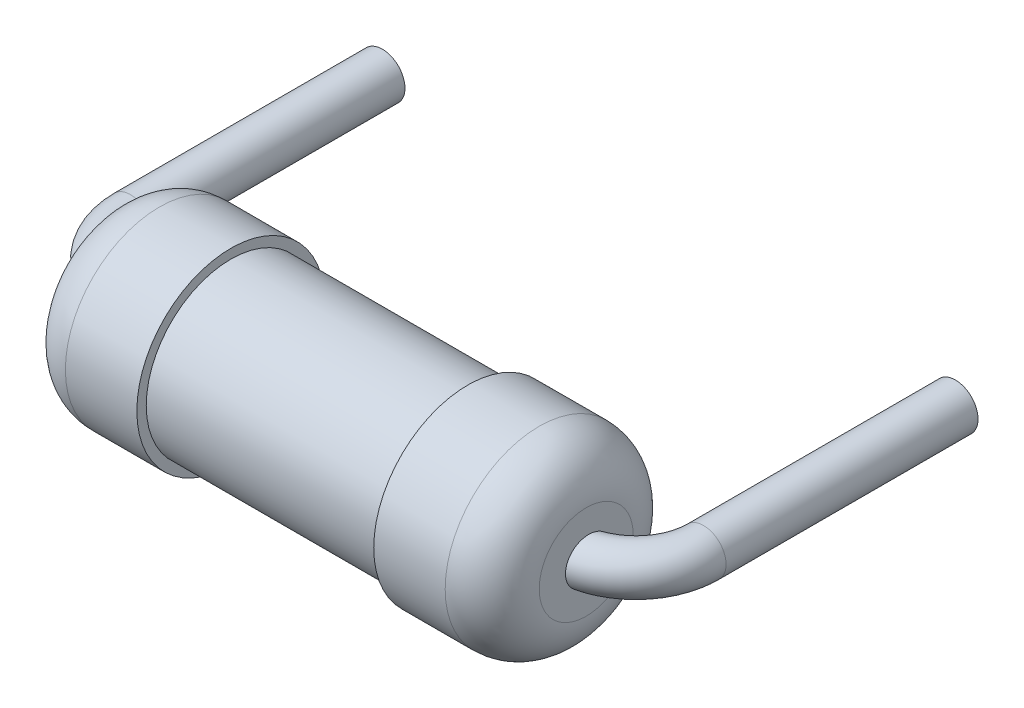
ISO-10303-21;
HEADER;
FILE_DESCRIPTION(('STEP AP214'),'2;1');
FILE_NAME('part.step','',(''),(''),'','','');
FILE_SCHEMA(('AUTOMOTIVE_DESIGN { 1 0 10303 214 1 1 1 1 }'));
ENDSEC;
DATA;
#1=APPLICATION_CONTEXT('core data for automotive mechanical design processes');
#2=APPLICATION_PROTOCOL_DEFINITION('international standard','automotive_design',2000,#1);
#3=PRODUCT_CONTEXT('',#1,'mechanical');
#4=PRODUCT('Part','Part','',(#3));
#5=PRODUCT_RELATED_PRODUCT_CATEGORY('part','',(#4));
#6=PRODUCT_DEFINITION_FORMATION('','',#4);
#7=PRODUCT_DEFINITION_CONTEXT('part definition',#1,'design');
#8=PRODUCT_DEFINITION('design','',#6,#7);
#9=PRODUCT_DEFINITION_SHAPE('','',#8);
#10=(LENGTH_UNIT() NAMED_UNIT(*) SI_UNIT(.MILLI.,.METRE.));
#11=(NAMED_UNIT(*) PLANE_ANGLE_UNIT() SI_UNIT($,.RADIAN.));
#12=(NAMED_UNIT(*) SI_UNIT($,.STERADIAN.) SOLID_ANGLE_UNIT());
#13=UNCERTAINTY_MEASURE_WITH_UNIT(LENGTH_MEASURE(1.E-05),#10,'distance_accuracy_value','');
#14=(GEOMETRIC_REPRESENTATION_CONTEXT(3) GLOBAL_UNCERTAINTY_ASSIGNED_CONTEXT((#13)) GLOBAL_UNIT_ASSIGNED_CONTEXT((#10,
#11,#12)) REPRESENTATION_CONTEXT('',''));
#15=CARTESIAN_POINT('',(0.,0.,0.));
#16=DIRECTION('',(0.,0.,1.));
#17=DIRECTION('',(1.,0.,0.));
#18=AXIS2_PLACEMENT_3D('',#15,#16,#17);
#19=CARTESIAN_POINT('',(7.32,-0.30606,-3.));
#20=DIRECTION('',(0.,0.,1.));
#21=DIRECTION('',(1.,0.,0.));
#22=AXIS2_PLACEMENT_3D('',#19,#20,#21);
#23=PLANE('',#22);
#24=CARTESIAN_POINT('',(7.61999999999981,0.,-3.));
#25=DIRECTION('',(0.,0.,-1.));
#26=DIRECTION('',(-1.,0.,0.));
#27=AXIS2_PLACEMENT_3D('',#24,#25,#26);
#28=CIRCLE('',#27,0.29999999999984);
#29=CARTESIAN_POINT('',(7.31999999999997,0.,-3.));
#30=VERTEX_POINT('',#29);
#31=EDGE_CURVE('E19',#30,#30,#28,.F.);
#32=ORIENTED_EDGE('',*,*,#31,.F.);
#33=EDGE_LOOP('',(#32));
#34=FACE_BOUND('',#33,.T.);
#35=ADVANCED_FACE('F15',(#34),#23,.F.);
#36=CARTESIAN_POINT('',(7.61999999999981,0.,0.35));
#37=DIRECTION('',(0.,0.,-1.));
#38=DIRECTION('',(-1.,0.,0.));
#39=AXIS2_PLACEMENT_3D('',#36,#37,#38);
#40=CYLINDRICAL_SURFACE('',#39,0.29999999999984);
#41=ORIENTED_EDGE('',*,*,#31,.T.);
#42=EDGE_LOOP('',(#41));
#43=FACE_BOUND('',#42,.T.);
#44=CARTESIAN_POINT('',(7.61999999999981,0.,0.35));
#45=DIRECTION('',(0.,0.,1.));
#46=DIRECTION('',(1.,0.,0.));
#47=AXIS2_PLACEMENT_3D('',#44,#45,#46);
#48=CIRCLE('',#47,0.29999999999984);
#49=CARTESIAN_POINT('',(7.91999999999965,0.,0.35));
#50=VERTEX_POINT('',#49);
#51=EDGE_CURVE('E31',#50,#50,#48,.T.);
#52=ORIENTED_EDGE('',*,*,#51,.F.);
#53=EDGE_LOOP('',(#52));
#54=FACE_BOUND('',#53,.T.);
#55=ADVANCED_FACE('F117',(#43,#54),#40,.T.);
#56=CARTESIAN_POINT('',(0.3,-0.30606,-3.));
#57=DIRECTION('',(0.,0.,-1.));
#58=DIRECTION('',(-1.,0.,0.));
#59=AXIS2_PLACEMENT_3D('',#56,#57,#58);
#60=PLANE('',#59);
#61=CARTESIAN_POINT('',(1.94411002053807E-13,0.,-3.));
#62=DIRECTION('',(0.,0.,1.));
#63=DIRECTION('',(1.,0.,0.));
#64=AXIS2_PLACEMENT_3D('',#61,#62,#63);
#65=CIRCLE('',#64,0.29999999999984);
#66=CARTESIAN_POINT('',(0.300000000000034,0.,-3.));
#67=VERTEX_POINT('',#66);
#68=EDGE_CURVE('E104',#67,#67,#65,.T.);
#69=ORIENTED_EDGE('',*,*,#68,.F.);
#70=EDGE_LOOP('',(#69));
#71=FACE_BOUND('',#70,.T.);
#72=ADVANCED_FACE('F125',(#71),#60,.T.);
#73=CARTESIAN_POINT('',(1.94411002053807E-13,0.,-3.));
#74=DIRECTION('',(0.,0.,1.));
#75=DIRECTION('',(1.,0.,0.));
#76=AXIS2_PLACEMENT_3D('',#73,#74,#75);
#77=CYLINDRICAL_SURFACE('',#76,0.29999999999984);
#78=CARTESIAN_POINT('',(1.94749815232709E-13,0.,0.35));
#79=DIRECTION('',(0.,0.,1.));
#80=DIRECTION('',(1.,0.,0.));
#81=AXIS2_PLACEMENT_3D('',#78,#79,#80);
#82=CIRCLE('',#81,0.29999999999984);
#83=CARTESIAN_POINT('',(0.300000000000035,0.,0.35));
#84=VERTEX_POINT('',#83);
#85=EDGE_CURVE('E102',#84,#84,#82,.T.);
#86=ORIENTED_EDGE('',*,*,#85,.F.);
#87=EDGE_LOOP('',(#86));
#88=FACE_BOUND('',#87,.T.);
#89=ORIENTED_EDGE('',*,*,#68,.T.);
#90=EDGE_LOOP('',(#89));
#91=FACE_BOUND('',#90,.T.);
#92=ADVANCED_FACE('F130',(#88,#91),#77,.T.);
#93=CARTESIAN_POINT('',(6.71999999999944,0.,0.349999999999999));
#94=DIRECTION('',(0.,1.,0.));
#95=DIRECTION('',(-1.,0.,0.));
#96=AXIS2_PLACEMENT_3D('',#93,#94,#95);
#97=TOROIDAL_SURFACE('',#96,0.899999999999279,0.299999999999489);
#98=CARTESIAN_POINT('',(6.96000000200153,0.,1.52575507816879));
#99=CARTESIAN_POINT('',(6.96000000239898,-0.0165717465702592,1.52575366689773));
#100=CARTESIAN_POINT('',(6.96000000064341,-0.0331576062207583,1.52434822630381));
#101=CARTESIAN_POINT('',(6.95999999935524,-0.0658828957445996,1.518760968371));
#102=CARTESIAN_POINT('',(6.95999999982733,-0.0820213152024847,1.51457332807748));
#103=CARTESIAN_POINT('',(6.96000000017247,-0.113348816615965,1.50355401757945));
#104=CARTESIAN_POINT('',(6.96000000004622,-0.128538973196427,1.49672540585315));
#105=CARTESIAN_POINT('',(6.9599999999538,-0.157560450627169,1.48063593905333));
#106=CARTESIAN_POINT('',(6.95999999998758,-0.171392368333133,1.47137615894805));
#107=CARTESIAN_POINT('',(6.96000000001251,-0.197432864941894,1.45062228585465));
#108=CARTESIAN_POINT('',(6.96000000000336,-0.209628545306149,1.43911201883619));
#109=CARTESIAN_POINT('',(6.95999999999664,-0.231959130917878,1.41424087231693));
#110=CARTESIAN_POINT('',(6.95999999999909,-0.242093718720324,1.40087970827691));
#111=CARTESIAN_POINT('',(6.96000000000092,-0.260228615435907,1.372416517639));
#112=CARTESIAN_POINT('',(6.96000000000025,-0.268184038441725,1.35728590846424));
#113=CARTESIAN_POINT('',(6.95999999999975,-0.281516811306086,1.32592981128039));
#114=CARTESIAN_POINT('',(6.95999999999993,-0.286893876392834,1.3097042025576));
#115=CARTESIAN_POINT('',(6.96000000000007,-0.295075780325206,1.27615269558577));
#116=CARTESIAN_POINT('',(6.96000000000002,-0.297807264113354,1.2588089191577));
#117=CARTESIAN_POINT('',(6.95999999999998,-0.300410822014324,1.22390857670864));
#118=CARTESIAN_POINT('',(6.95999999999999,-0.300282447435237,1.20635197772913));
#119=CARTESIAN_POINT('',(6.96000000000001,-0.29715910251184,1.17096630628855));
#120=CARTESIAN_POINT('',(6.96,-0.294078574038098,1.15314477222957));
#121=CARTESIAN_POINT('',(6.96,-0.285034910762784,1.11824738099647));
#122=CARTESIAN_POINT('',(6.96,-0.279071268028983,1.10117165579331));
#123=CARTESIAN_POINT('',(6.96,-0.264267898815892,1.06787386585412));
#124=CARTESIAN_POINT('',(6.96,-0.255369306022341,1.05167791922303));
#125=CARTESIAN_POINT('',(6.96,-0.23496045761772,1.02102069910626));
#126=CARTESIAN_POINT('',(6.96,-0.223450133263215,1.00655947129546));
#127=CARTESIAN_POINT('',(6.96,-0.198203092033218,0.979953759756814));
#128=CARTESIAN_POINT('',(6.96,-0.184485612526183,0.967791073045381));
#129=CARTESIAN_POINT('',(6.96,-0.15509338205597,0.946094783766567));
#130=CARTESIAN_POINT('',(6.96,-0.13941835189566,0.936561556851437));
#131=CARTESIAN_POINT('',(6.96,-0.107469905856262,0.921013444039079));
#132=CARTESIAN_POINT('',(6.96,-0.0912764867236528,0.914834240349325));
#133=CARTESIAN_POINT('',(6.96,-0.0580624647700204,0.905555799337871));
#134=CARTESIAN_POINT('',(6.96,-0.0410445486460067,0.902447182416433));
#135=CARTESIAN_POINT('',(6.96,-0.0159590419049933,0.900255534627323));
#136=CARTESIAN_POINT('',(6.96,-0.00798203854928741,0.899907973729281));
#137=CARTESIAN_POINT('',(6.96,0.0159391519228464,0.899911299259022));
#138=CARTESIAN_POINT('',(6.96,0.0318983817763698,0.901303845660108));
#139=CARTESIAN_POINT('',(6.96,0.0633648904786639,0.906813453242073));
#140=CARTESIAN_POINT('',(6.96,0.0788709896929494,0.910937060798986));
#141=CARTESIAN_POINT('',(6.96,0.108925948621917,0.921697884375491));
#142=CARTESIAN_POINT('',(6.96,0.123477708884365,0.928327025977768));
#143=CARTESIAN_POINT('',(6.96,0.151320221170094,0.943827197468842));
#144=CARTESIAN_POINT('',(6.96,0.164611333680649,0.952697583790299));
#145=CARTESIAN_POINT('',(6.96,0.190219362874737,0.972819500485144));
#146=CARTESIAN_POINT('',(6.96,0.202466858548362,0.984159241147546));
#147=CARTESIAN_POINT('',(6.96,0.225042095487014,1.00861184019665));
#148=CARTESIAN_POINT('',(6.96,0.235369137216857,1.02172534169215));
#149=CARTESIAN_POINT('',(6.96,0.254552458048837,1.05035899866851));
#150=CARTESIAN_POINT('',(6.96,0.263252811883518,1.06598381752323));
#151=CARTESIAN_POINT('',(6.96,0.278006061841171,1.09843823214625));
#152=CARTESIAN_POINT('',(6.96,0.284058405625977,1.11526807841547));
#153=CARTESIAN_POINT('',(6.96,0.293506450974995,1.15025941287104));
#154=CARTESIAN_POINT('',(6.96000000000001,0.296807654597934,1.16844653461609));
#155=CARTESIAN_POINT('',(6.95999999999999,0.300288413441444,1.2051185718321));
#156=CARTESIAN_POINT('',(6.95999999999997,0.30046797567003,1.22360348663442));
#157=CARTESIAN_POINT('',(6.96000000000003,0.29766769305614,1.26020661691794));
#158=CARTESIAN_POINT('',(6.9600000000001,0.294709597823849,1.27832648107846));
#159=CARTESIAN_POINT('',(6.9599999999999,0.28570596282675,1.31378369043589));
#160=CARTESIAN_POINT('',(6.95999999999964,0.279660812116659,1.33112113393994));
#161=CARTESIAN_POINT('',(6.96000000000035,0.26482667035609,1.36400922822503));
#162=CARTESIAN_POINT('',(6.9600000000013,0.256117396466872,1.37959582018153));
#163=CARTESIAN_POINT('',(6.9599999999987,0.236129026378305,1.40902256316334));
#164=CARTESIAN_POINT('',(6.95999999999515,0.224850581414088,1.42286315538672));
#165=CARTESIAN_POINT('',(6.9600000000047,0.200415519129505,1.44796272434007));
#166=CARTESIAN_POINT('',(6.9600000000173,0.187326195707308,1.45928723795935));
#167=CARTESIAN_POINT('',(6.95999999998269,0.159386195679297,1.47951897893741));
#168=CARTESIAN_POINT('',(6.95999999993546,0.144534942399504,1.48842541171226));
#169=CARTESIAN_POINT('',(6.96000000006307,0.113869961667255,1.50335184691495));
#170=CARTESIAN_POINT('',(6.96000000023284,0.0980860819871803,1.50943330659099));
#171=CARTESIAN_POINT('',(6.95999999976767,0.0657390556120207,1.51880335836358));
#172=CARTESIAN_POINT('',(6.9599999991345,0.049177716110643,1.5220981188035));
#173=CARTESIAN_POINT('',(6.96000000055857,0.0216899661657272,1.52515528192975));
#174=CARTESIAN_POINT('',(6.96000000174135,0.0108480068974013,1.52575600199889));
#175=CARTESIAN_POINT('',(6.96000000200153,0.,1.52575507816879));
#176=B_SPLINE_CURVE_WITH_KNOTS('',3,(#98,#99,#100,#101,#102,#103,#104,#105,#106,#107,#108,#109,
#110,#111,#112,#113,#114,#115,#116,#117,#118,#119,#120,#121,#122,#123,#124,#125,#126,#127,#128,
#129,#130,#131,#132,#133,#134,#135,#136,#137,#138,#139,#140,#141,#142,#143,#144,#145,#146,#147,
#148,#149,#150,#151,#152,#153,#154,#155,#156,#157,#158,#159,#160,#161,#162,#163,#164,#165,#166,
#167,#168,#169,#170,#171,#172,#173,#174,#175),.UNSPECIFIED.,.T.,.F.,(4,2,2,2,2,2,2,2,2,2,2,2,2,
2,2,2,2,2,2,2,2,2,2,2,2,2,2,2,2,2,2,2,2,2,2,2,2,2,4),(0.,0.049680736121407,0.0994657795787804,
0.149193339372714,0.19889894849212,0.248975868404632,0.299060495224995,0.35011015455782,
0.401165450872408,0.453598973876442,0.506040723393907,0.560049778387794,0.614068351888266,
0.66924393763271,0.724420975823266,0.77914083518832,0.833868507946833,0.885593975729398,
0.937160946583132,0.961094778677505,1.0088877056964,1.05679560939149,1.10455042197684,
1.15229153745048,1.20215158606851,1.25202976104181,1.30543981297232,1.3588610001937,
1.41404924179432,1.46923735949858,1.52404540904007,1.57884655294932,1.63214619044925,
1.68543233252715,1.73710326700358,1.78879116011017,1.83929480367792,1.88968636295174,
1.92220779729997),.UNSPECIFIED.);
#177=CARTESIAN_POINT('',(6.96000000200153,0.,1.52575507816879));
#178=VERTEX_POINT('',#177);
#179=EDGE_CURVE('E54',#178,#178,#176,.T.);
#180=ORIENTED_EDGE('',*,*,#179,.T.);
#181=EDGE_LOOP('',(#180));
#182=FACE_BOUND('',#181,.T.);
#183=ORIENTED_EDGE('',*,*,#51,.T.);
#184=EDGE_LOOP('',(#183));
#185=FACE_BOUND('',#184,.T.);
#186=ADVANCED_FACE('F133',(#182,#185),#97,.T.);
#187=CARTESIAN_POINT('',(0.899999999999423,0.,0.35));
#188=DIRECTION('',(0.,1.,0.));
#189=DIRECTION('',(-1.,0.,0.));
#190=AXIS2_PLACEMENT_3D('',#187,#188,#189);
#191=TOROIDAL_SURFACE('',#190,0.899999999999228,0.29999999999984);
#192=CARTESIAN_POINT('',(0.66,0.,0.899909083394285));
#193=CARTESIAN_POINT('',(0.66,0.015939151922877,0.899911299259076));
#194=CARTESIAN_POINT('',(0.66,0.0318983817764273,0.901303845660167));
#195=CARTESIAN_POINT('',(0.66,0.0633648904787725,0.906813453242143));
#196=CARTESIAN_POINT('',(0.66,0.0788709896930825,0.91093706079906));
#197=CARTESIAN_POINT('',(0.66,0.108925948622089,0.921697884375577));
#198=CARTESIAN_POINT('',(0.66,0.123477708884552,0.928327025977858));
#199=CARTESIAN_POINT('',(0.66,0.151320221170329,0.943827197468954));
#200=CARTESIAN_POINT('',(0.66,0.164611333680916,0.952697583790432));
#201=CARTESIAN_POINT('',(0.66,0.190219362875102,0.972819500485356));
#202=CARTESIAN_POINT('',(0.66,0.202466858548788,0.984159241147822));
#203=CARTESIAN_POINT('',(0.66,0.225042095487452,1.00861184019698));
#204=CARTESIAN_POINT('',(0.66,0.235369137217262,1.02172534169245));
#205=CARTESIAN_POINT('',(0.66,0.254552458049035,1.05035899866852));
#206=CARTESIAN_POINT('',(0.66,0.263252811883582,1.06598381752295));
#207=CARTESIAN_POINT('',(0.66,0.278006061841332,1.09843823214595));
#208=CARTESIAN_POINT('',(0.66,0.284058405626274,1.11526807841549));
#209=CARTESIAN_POINT('',(0.66,0.293506450975729,1.15025941287273));
#210=CARTESIAN_POINT('',(0.66,0.296807654598798,1.16844653461918));
#211=CARTESIAN_POINT('',(0.66,0.300288413441829,1.20511857183526));
#212=CARTESIAN_POINT('',(0.66,0.300467975670273,1.22360348663621));
#213=CARTESIAN_POINT('',(0.66,0.297667693056851,1.26020661691341));
#214=CARTESIAN_POINT('',(0.66,0.29470959782577,1.27832648106902));
#215=CARTESIAN_POINT('',(0.66,0.28570596283032,1.31378369042703));
#216=CARTESIAN_POINT('',(0.66,0.279660812119012,1.33112113393615));
#217=CARTESIAN_POINT('',(0.66,0.264826670350286,1.36400922823865));
#218=CARTESIAN_POINT('',(0.66,0.256117396452608,1.37959582020684));
#219=CARTESIAN_POINT('',(0.66,0.23612902635983,1.40902256318791));
#220=CARTESIAN_POINT('',(0.66,0.224850581404126,1.42286315540176));
#221=CARTESIAN_POINT('',(0.66,0.200415519154835,1.44796272431079));
#222=CARTESIAN_POINT('',(0.66,0.187326195761993,1.45928723789819));
#223=CARTESIAN_POINT('',(0.66,0.159386195742373,1.47951897891456));
#224=CARTESIAN_POINT('',(0.66,0.144534942434262,1.48842541174948));
#225=CARTESIAN_POINT('',(0.66,0.113869961615406,1.50335184688845));
#226=CARTESIAN_POINT('',(0.66,0.0980860818758177,1.50943330644199));
#227=CARTESIAN_POINT('',(0.66,0.0657390555095999,1.51880335857524));
#228=CARTESIAN_POINT('',(0.66,0.0491777160819807,1.52209811951517));
#229=CARTESIAN_POINT('',(0.66,0.0216899661803045,1.52515528147179));
#230=CARTESIAN_POINT('',(0.66,0.0108480069077052,1.52575600057752));
#231=CARTESIAN_POINT('',(0.66,-0.0165717466706921,1.52575366493966));
#232=CARTESIAN_POINT('',(0.66,-0.0331576064293321,1.52434822575765));
#233=CARTESIAN_POINT('',(0.66,-0.0658828959463421,1.51876096884922));
#234=CARTESIAN_POINT('',(0.66,-0.0820213152932457,1.51457332818834));
#235=CARTESIAN_POINT('',(0.66,-0.113348816556747,1.50355401745879));
#236=CARTESIAN_POINT('',(0.66,-0.128538973095773,1.49672540586089));
#237=CARTESIAN_POINT('',(0.66,-0.157560450538399,1.48063593915178));
#238=CARTESIAN_POINT('',(0.66,-0.171392368289278,1.47137615899373));
#239=CARTESIAN_POINT('',(0.66,-0.197432864955946,1.45062228583395));
#240=CARTESIAN_POINT('',(0.66,-0.209628545336172,1.43911201880586));
#241=CARTESIAN_POINT('',(0.66,-0.231959130942909,1.4142408722874));
#242=CARTESIAN_POINT('',(0.66,-0.242093718730023,1.40087970826285));
#243=CARTESIAN_POINT('',(0.66,-0.260228615429383,1.37241651764982));
#244=CARTESIAN_POINT('',(0.66,-0.268184038432296,1.35728590848324));
#245=CARTESIAN_POINT('',(0.66,-0.281516811299615,1.32592981130104));
#246=CARTESIAN_POINT('',(0.66,-0.286893876389798,1.30970420257066));
#247=CARTESIAN_POINT('',(0.66,-0.295075780325203,1.27615269558863));
#248=CARTESIAN_POINT('',(0.66,-0.297807264113813,1.25880891915815));
#249=CARTESIAN_POINT('',(0.66,-0.300410822014535,1.22390857670913));
#250=CARTESIAN_POINT('',(0.66,-0.300282447435548,1.20635197773214));
#251=CARTESIAN_POINT('',(0.66,-0.297159102513001,1.17096630629469));
#252=CARTESIAN_POINT('',(0.66,-0.294078574039725,1.15314477223635));
#253=CARTESIAN_POINT('',(0.66,-0.285034910765201,1.11824738100308));
#254=CARTESIAN_POINT('',(0.66,-0.279071268031507,1.10117165579916));
#255=CARTESIAN_POINT('',(0.66,-0.26426789881862,1.06787386585897));
#256=CARTESIAN_POINT('',(0.66,-0.255369306025244,1.0516779192276));
#257=CARTESIAN_POINT('',(0.66,-0.23496045762109,1.02102069911052));
#258=CARTESIAN_POINT('',(0.66,-0.223450133266924,1.00655947129967));
#259=CARTESIAN_POINT('',(0.66,-0.198203092037496,0.979953759760712));
#260=CARTESIAN_POINT('',(0.66,-0.18448561253067,0.967791073049037));
#261=CARTESIAN_POINT('',(0.66,-0.155093382060787,0.946094783769654));
#262=CARTESIAN_POINT('',(0.66,-0.139418351900591,0.936561556854207));
#263=CARTESIAN_POINT('',(0.66,-0.107469905861335,0.921013444041198));
#264=CARTESIAN_POINT('',(0.66,-0.0912764867287552,0.914834240351116));
#265=CARTESIAN_POINT('',(0.66,-0.0580624647751282,0.905555799339011));
#266=CARTESIAN_POINT('',(0.66,-0.0410445486510903,0.902447182417247));
#267=CARTESIAN_POINT('',(0.66,-0.0159590419083555,0.900255534627526));
#268=CARTESIAN_POINT('',(0.66,-0.00798203855096906,0.899907973729337));
#269=CARTESIAN_POINT('',(0.66,0.,0.899909083394285));
#270=B_SPLINE_CURVE_WITH_KNOTS('',3,(#192,#193,#194,#195,#196,#197,#198,#199,#200,#201,#202,
#203,#204,#205,#206,#207,#208,#209,#210,#211,#212,#213,#214,#215,#216,#217,#218,#219,#220,#221,
#222,#223,#224,#225,#226,#227,#228,#229,#230,#231,#232,#233,#234,#235,#236,#237,#238,#239,#240,
#241,#242,#243,#244,#245,#246,#247,#248,#249,#250,#251,#252,#253,#254,#255,#256,#257,#258,#259,
#260,#261,#262,#263,#264,#265,#266,#267,#268,#269),.UNSPECIFIED.,.T.,.F.,(4,2,2,2,2,2,2,2,2,2,2,
2,2,2,2,2,2,2,2,2,2,2,2,2,2,2,2,2,2,2,2,2,2,2,2,2,2,2,4),(0.,0.0477929270189792,
0.0957008307141397,0.143455643299536,0.191196758773294,0.241056807391585,0.290934982364753,
0.344345034294326,0.397766221516729,0.452954463121501,0.508142580821649,0.562950630348449,
0.617751774272426,0.671051411816582,0.724337553850323,0.776008488218665,0.827696381433435,
0.878200025167519,0.928591584275127,0.961113018528108,1.01079375479502,1.0605787979689,
1.11030635760828,1.16001196688235,1.21008888686324,1.26017351361527,1.31122317292405,
1.36227846926268,1.4147119922741,1.46715374178411,1.52116279677589,1.57518137027837,
1.6303569560233,1.68553399421335,1.74025385357842,1.79498152633714,1.84670699411997,
1.89827396497395,1.92220779707336),.UNSPECIFIED.);
#271=CARTESIAN_POINT('',(0.66,0.,0.899909083394285));
#272=VERTEX_POINT('',#271);
#273=EDGE_CURVE('E47',#272,#272,#270,.T.);
#274=ORIENTED_EDGE('',*,*,#273,.F.);
#275=EDGE_LOOP('',(#274));
#276=FACE_BOUND('',#275,.T.);
#277=ORIENTED_EDGE('',*,*,#85,.T.);
#278=EDGE_LOOP('',(#277));
#279=FACE_BOUND('',#278,.T.);
#280=ADVANCED_FACE('F59',(#276,#279),#191,.T.);
#281=CARTESIAN_POINT('',(6.96,0.625,1.887625));
#282=DIRECTION('',(-1.,0.,0.));
#283=DIRECTION('',(0.,0.,-1.));
#284=AXIS2_PLACEMENT_3D('',#281,#282,#283);
#285=PLANE('',#284);
#286=ORIENTED_EDGE('',*,*,#179,.F.);
#287=EDGE_LOOP('',(#286));
#288=FACE_BOUND('',#287,.T.);
#289=CARTESIAN_POINT('',(6.96000000000002,0.,1.25));
#290=DIRECTION('',(1.,0.,0.));
#291=DIRECTION('',(0.,0.,-1.));
#292=AXIS2_PLACEMENT_3D('',#289,#290,#291);
#293=CIRCLE('',#292,0.625000000000056);
#294=CARTESIAN_POINT('',(6.96000000000002,0.,0.624999999999944));
#295=VERTEX_POINT('',#294);
#296=EDGE_CURVE('E44',#295,#295,#293,.F.);
#297=ORIENTED_EDGE('',*,*,#296,.F.);
#298=EDGE_LOOP('',(#297));
#299=FACE_BOUND('',#298,.T.);
#300=ADVANCED_FACE('F66',(#288,#299),#285,.F.);
#301=CARTESIAN_POINT('',(0.66,0.625,1.8875));
#302=DIRECTION('',(-1.,0.,0.));
#303=DIRECTION('',(0.,0.,-1.));
#304=AXIS2_PLACEMENT_3D('',#301,#302,#303);
#305=PLANE('',#304);
#306=ORIENTED_EDGE('',*,*,#273,.T.);
#307=EDGE_LOOP('',(#306));
#308=FACE_BOUND('',#307,.T.);
#309=CARTESIAN_POINT('',(0.659999999999977,0.,1.25));
#310=DIRECTION('',(-1.,0.,0.));
#311=DIRECTION('',(0.,0.,1.));
#312=AXIS2_PLACEMENT_3D('',#309,#310,#311);
#313=CIRCLE('',#312,0.625000000000056);
#314=CARTESIAN_POINT('',(0.659999999999977,0.,1.87500000000006));
#315=VERTEX_POINT('',#314);
#316=EDGE_CURVE('E40',#315,#315,#313,.F.);
#317=ORIENTED_EDGE('',*,*,#316,.F.);
#318=EDGE_LOOP('',(#317));
#319=FACE_BOUND('',#318,.T.);
#320=ADVANCED_FACE('F61',(#308,#319),#305,.T.);
#321=CARTESIAN_POINT('',(6.335,0.,1.25));
#322=DIRECTION('',(1.,0.,0.));
#323=DIRECTION('',(0.,0.,-1.));
#324=AXIS2_PLACEMENT_3D('',#321,#322,#323);
#325=TOROIDAL_SURFACE('',#324,0.625000000000056,0.625000000000023);
#326=CARTESIAN_POINT('',(6.335,0.,1.25));
#327=DIRECTION('',(-1.,0.,0.));
#328=DIRECTION('',(0.,0.,1.));
#329=AXIS2_PLACEMENT_3D('',#326,#327,#328);
#330=CIRCLE('',#329,1.25000000000018);
#331=CARTESIAN_POINT('',(6.335,0.,2.50000000000018));
#332=VERTEX_POINT('',#331);
#333=EDGE_CURVE('E43',#332,#332,#330,.T.);
#334=ORIENTED_EDGE('',*,*,#333,.F.);
#335=EDGE_LOOP('',(#334));
#336=FACE_BOUND('',#335,.T.);
#337=ORIENTED_EDGE('',*,*,#296,.T.);
#338=EDGE_LOOP('',(#337));
#339=FACE_BOUND('',#338,.T.);
#340=ADVANCED_FACE('F65',(#336,#339),#325,.T.);
#341=CARTESIAN_POINT('',(1.285,0.,1.25));
#342=DIRECTION('',(-1.,0.,0.));
#343=DIRECTION('',(0.,0.,1.));
#344=AXIS2_PLACEMENT_3D('',#341,#342,#343);
#345=TOROIDAL_SURFACE('',#344,0.625000000000056,0.625000000000023);
#346=CARTESIAN_POINT('',(1.285,0.,1.25));
#347=DIRECTION('',(1.,0.,0.));
#348=DIRECTION('',(0.,0.,-1.));
#349=AXIS2_PLACEMENT_3D('',#346,#347,#348);
#350=CIRCLE('',#349,1.25000000000018);
#351=CARTESIAN_POINT('',(1.285,0.,-1.8323016715005E-13));
#352=VERTEX_POINT('',#351);
#353=EDGE_CURVE('E39',#352,#352,#350,.T.);
#354=ORIENTED_EDGE('',*,*,#353,.F.);
#355=EDGE_LOOP('',(#354));
#356=FACE_BOUND('',#355,.T.);
#357=ORIENTED_EDGE('',*,*,#316,.T.);
#358=EDGE_LOOP('',(#357));
#359=FACE_BOUND('',#358,.T.);
#360=ADVANCED_FACE('F71',(#356,#359),#345,.T.);
#361=CARTESIAN_POINT('',(6.335,0.,1.25));
#362=DIRECTION('',(-1.,0.,0.));
#363=DIRECTION('',(0.,0.,1.));
#364=AXIS2_PLACEMENT_3D('',#361,#362,#363);
#365=CYLINDRICAL_SURFACE('',#364,1.25000000000018);
#366=CARTESIAN_POINT('',(5.385,0.,1.25));
#367=DIRECTION('',(-1.,0.,0.));
#368=DIRECTION('',(0.,0.,1.));
#369=AXIS2_PLACEMENT_3D('',#366,#367,#368);
#370=CIRCLE('',#369,1.25000000000018);
#371=CARTESIAN_POINT('',(5.385,0.,2.50000000000018));
#372=VERTEX_POINT('',#371);
#373=EDGE_CURVE('E36',#372,#372,#370,.T.);
#374=ORIENTED_EDGE('',*,*,#373,.F.);
#375=EDGE_LOOP('',(#374));
#376=FACE_BOUND('',#375,.T.);
#377=ORIENTED_EDGE('',*,*,#333,.T.);
#378=EDGE_LOOP('',(#377));
#379=FACE_BOUND('',#378,.T.);
#380=ADVANCED_FACE('F75',(#376,#379),#365,.T.);
#381=CARTESIAN_POINT('',(2.235,0.,1.25));
#382=DIRECTION('',(-1.,0.,0.));
#383=DIRECTION('',(0.,0.,1.));
#384=AXIS2_PLACEMENT_3D('',#381,#382,#383);
#385=CYLINDRICAL_SURFACE('',#384,1.25000000000018);
#386=CARTESIAN_POINT('',(2.235,0.,1.25));
#387=DIRECTION('',(-1.,0.,0.));
#388=DIRECTION('',(0.,0.,1.));
#389=AXIS2_PLACEMENT_3D('',#386,#387,#388);
#390=CIRCLE('',#389,1.25000000000018);
#391=CARTESIAN_POINT('',(2.235,0.,2.50000000000018));
#392=VERTEX_POINT('',#391);
#393=EDGE_CURVE('E28',#392,#392,#390,.T.);
#394=ORIENTED_EDGE('',*,*,#393,.T.);
#395=EDGE_LOOP('',(#394));
#396=FACE_BOUND('',#395,.T.);
#397=ORIENTED_EDGE('',*,*,#353,.T.);
#398=EDGE_LOOP('',(#397));
#399=FACE_BOUND('',#398,.T.);
#400=ADVANCED_FACE('F79',(#396,#399),#385,.T.);
#401=CARTESIAN_POINT('',(5.385,1.25,2.525));
#402=DIRECTION('',(-1.,0.,0.));
#403=DIRECTION('',(0.,0.,-1.));
#404=AXIS2_PLACEMENT_3D('',#401,#402,#403);
#405=PLANE('',#404);
#406=CARTESIAN_POINT('',(5.385,0.,1.25));
#407=DIRECTION('',(-1.,0.,0.));
#408=DIRECTION('',(0.,0.,1.));
#409=AXIS2_PLACEMENT_3D('',#406,#407,#408);
#410=CIRCLE('',#409,1.12499999999981);
#411=CARTESIAN_POINT('',(5.385,0.,2.37499999999981));
#412=VERTEX_POINT('',#411);
#413=EDGE_CURVE('E23',#412,#412,#410,.T.);
#414=ORIENTED_EDGE('',*,*,#413,.F.);
#415=EDGE_LOOP('',(#414));
#416=FACE_BOUND('',#415,.T.);
#417=ORIENTED_EDGE('',*,*,#373,.T.);
#418=EDGE_LOOP('',(#417));
#419=FACE_BOUND('',#418,.T.);
#420=ADVANCED_FACE('F83',(#416,#419),#405,.T.);
#421=CARTESIAN_POINT('',(2.235,1.25,2.52525));
#422=DIRECTION('',(-1.,0.,0.));
#423=DIRECTION('',(0.,0.,-1.));
#424=AXIS2_PLACEMENT_3D('',#421,#422,#423);
#425=PLANE('',#424);
#426=CARTESIAN_POINT('',(2.235,0.,1.25));
#427=DIRECTION('',(-1.,0.,0.));
#428=DIRECTION('',(0.,0.,1.));
#429=AXIS2_PLACEMENT_3D('',#426,#427,#428);
#430=CIRCLE('',#429,1.12499999999981);
#431=CARTESIAN_POINT('',(2.235,0.,2.37499999999981));
#432=VERTEX_POINT('',#431);
#433=EDGE_CURVE('E10',#432,#432,#430,.F.);
#434=ORIENTED_EDGE('',*,*,#433,.F.);
#435=EDGE_LOOP('',(#434));
#436=FACE_BOUND('',#435,.T.);
#437=ORIENTED_EDGE('',*,*,#393,.F.);
#438=EDGE_LOOP('',(#437));
#439=FACE_BOUND('',#438,.T.);
#440=ADVANCED_FACE('F86',(#436,#439),#425,.F.);
#441=CARTESIAN_POINT('',(5.385,0.,1.25));
#442=DIRECTION('',(-1.,0.,0.));
#443=DIRECTION('',(0.,0.,1.));
#444=AXIS2_PLACEMENT_3D('',#441,#442,#443);
#445=CYLINDRICAL_SURFACE('',#444,1.12499999999981);
#446=ORIENTED_EDGE('',*,*,#433,.T.);
#447=EDGE_LOOP('',(#446));
#448=FACE_BOUND('',#447,.T.);
#449=ORIENTED_EDGE('',*,*,#413,.T.);
#450=EDGE_LOOP('',(#449));
#451=FACE_BOUND('',#450,.T.);
#452=ADVANCED_FACE('F17',(#448,#451),#445,.T.);
#453=CLOSED_SHELL('',(#35,#55,#72,#92,#186,#280,#300,#320,#340,#360,#380,#400,#420,#440,#452));
#454=MANIFOLD_SOLID_BREP('B1',#453);
#455=ADVANCED_BREP_SHAPE_REPRESENTATION('',(#18,#454),#14);
#456=SHAPE_DEFINITION_REPRESENTATION(#9,#455);
ENDSEC;
END-ISO-10303-21;
